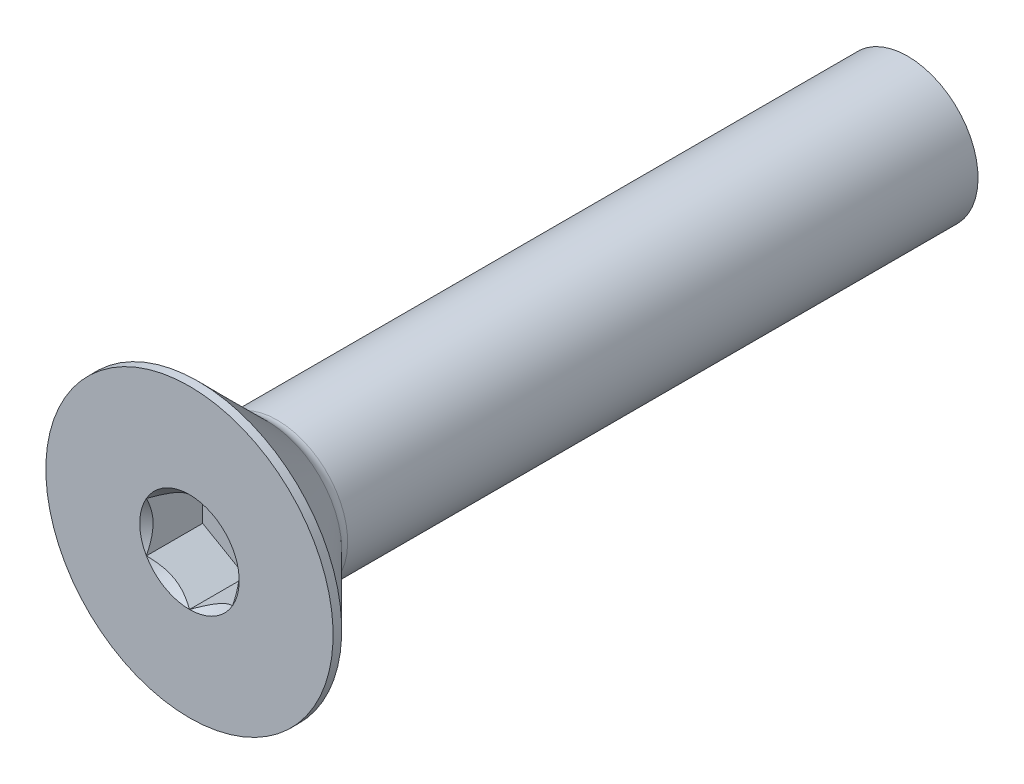
ISO-10303-21;
HEADER;
FILE_DESCRIPTION(('STEP AP214'),'2;1');
FILE_NAME('part.step','',(''),(''),'','','');
FILE_SCHEMA(('AUTOMOTIVE_DESIGN { 1 0 10303 214 1 1 1 1 }'));
ENDSEC;
DATA;
#1=APPLICATION_CONTEXT('core data for automotive mechanical design processes');
#2=APPLICATION_PROTOCOL_DEFINITION('international standard','automotive_design',2000,#1);
#3=PRODUCT_CONTEXT('',#1,'mechanical');
#4=PRODUCT('Part','Part','',(#3));
#5=PRODUCT_RELATED_PRODUCT_CATEGORY('part','',(#4));
#6=PRODUCT_DEFINITION_FORMATION('','',#4);
#7=PRODUCT_DEFINITION_CONTEXT('part definition',#1,'design');
#8=PRODUCT_DEFINITION('design','',#6,#7);
#9=PRODUCT_DEFINITION_SHAPE('','',#8);
#10=(LENGTH_UNIT() NAMED_UNIT(*) SI_UNIT(.MILLI.,.METRE.));
#11=(NAMED_UNIT(*) PLANE_ANGLE_UNIT() SI_UNIT($,.RADIAN.));
#12=(NAMED_UNIT(*) SI_UNIT($,.STERADIAN.) SOLID_ANGLE_UNIT());
#13=UNCERTAINTY_MEASURE_WITH_UNIT(LENGTH_MEASURE(1.E-05),#10,'distance_accuracy_value','');
#14=(GEOMETRIC_REPRESENTATION_CONTEXT(3) GLOBAL_UNCERTAINTY_ASSIGNED_CONTEXT((#13)) GLOBAL_UNIT_ASSIGNED_CONTEXT((#10,
#11,#12)) REPRESENTATION_CONTEXT('',''));
#15=CARTESIAN_POINT('',(0.,0.,0.));
#16=DIRECTION('',(0.,0.,1.));
#17=DIRECTION('',(1.,0.,0.));
#18=AXIS2_PLACEMENT_3D('',#15,#16,#17);
#19=CARTESIAN_POINT('',(1.5,-0.866025403784439,-1.96));
#20=DIRECTION('',(0.,0.,1.));
#21=DIRECTION('',(1.,0.,0.));
#22=AXIS2_PLACEMENT_3D('',#19,#20,#21);
#23=PLANE('',#22);
#24=DIRECTION('',(0.,1.,0.));
#25=VECTOR('',#24,1.);
#26=CARTESIAN_POINT('',(-1.5,0.86602540378444,-1.96));
#27=LINE('',#26,#25);
#28=CARTESIAN_POINT('',(-1.5,0.866025403784441,-1.96));
#29=VERTEX_POINT('',#28);
#30=CARTESIAN_POINT('',(-1.5,-0.866025403784438,-1.96));
#31=VERTEX_POINT('',#30);
#32=EDGE_CURVE('E82',#29,#31,#27,.F.);
#33=ORIENTED_EDGE('',*,*,#32,.T.);
#34=DIRECTION('',(0.866025403784439,-0.5,0.));
#35=VECTOR('',#34,1.);
#36=CARTESIAN_POINT('',(-1.5,-0.866025403784438,-1.96));
#37=LINE('',#36,#35);
#38=CARTESIAN_POINT('',(0.,-1.73205080756888,-1.96));
#39=VERTEX_POINT('',#38);
#40=EDGE_CURVE('E84',#31,#39,#37,.T.);
#41=ORIENTED_EDGE('',*,*,#40,.T.);
#42=DIRECTION('',(0.866025403784439,0.5,0.));
#43=VECTOR('',#42,1.);
#44=CARTESIAN_POINT('',(0.,-1.73205080756888,-1.96));
#45=LINE('',#44,#43);
#46=CARTESIAN_POINT('',(1.5,-0.866025403784443,-1.96));
#47=VERTEX_POINT('',#46);
#48=EDGE_CURVE('E85',#39,#47,#45,.T.);
#49=ORIENTED_EDGE('',*,*,#48,.T.);
#50=DIRECTION('',(0.,1.,0.));
#51=VECTOR('',#50,1.);
#52=CARTESIAN_POINT('',(1.5,-0.866025403784439,-1.96));
#53=LINE('',#52,#51);
#54=CARTESIAN_POINT('',(1.5,0.866025403784441,-1.96));
#55=VERTEX_POINT('',#54);
#56=EDGE_CURVE('E71',#47,#55,#53,.T.);
#57=ORIENTED_EDGE('',*,*,#56,.T.);
#58=DIRECTION('',(-0.866025403784439,0.5,0.));
#59=VECTOR('',#58,1.);
#60=CARTESIAN_POINT('',(1.5,0.866025403784441,-1.96));
#61=LINE('',#60,#59);
#62=CARTESIAN_POINT('',(0.,1.73205080756888,-1.96));
#63=VERTEX_POINT('',#62);
#64=EDGE_CURVE('E110',#55,#63,#61,.T.);
#65=ORIENTED_EDGE('',*,*,#64,.T.);
#66=DIRECTION('',(-0.866025403784439,-0.5,0.));
#67=VECTOR('',#66,1.);
#68=CARTESIAN_POINT('',(0.,1.73205080756888,-1.96));
#69=LINE('',#68,#67);
#70=EDGE_CURVE('E115',#63,#29,#69,.T.);
#71=ORIENTED_EDGE('',*,*,#70,.T.);
#72=EDGE_LOOP('',(#33,#41,#49,#57,#65,#71));
#73=FACE_BOUND('',#72,.T.);
#74=ADVANCED_FACE('F16',(#73),#23,.T.);
#75=CARTESIAN_POINT('',(0.,-1.73205080756888,-1.96));
#76=DIRECTION('',(0.5,-0.866025403784439,0.));
#77=DIRECTION('',(0.866025403784439,0.5,0.));
#78=AXIS2_PLACEMENT_3D('',#75,#76,#77);
#79=PLANE('',#78);
#80=CARTESIAN_POINT('',(-2.47259574257012E-11,-1.73205080758293,-3.49735601031853E-11));
#81=CARTESIAN_POINT('',(0.0515557327287652,-1.70228509139958,-0.0297371504849992));
#82=CARTESIAN_POINT('',(0.103973478126706,-1.67202169198382,-0.0577274997332092));
#83=CARTESIAN_POINT('',(0.210858640221865,-1.61031151487585,-0.108976634295227));
#84=CARTESIAN_POINT('',(0.265336216149331,-1.57885887174931,-0.132206913925154));
#85=CARTESIAN_POINT('',(0.375187576360525,-1.51543615936052,-0.172000539063642));
#86=CARTESIAN_POINT('',(0.43053339988551,-1.48348223324985,-0.188663877355985));
#87=CARTESIAN_POINT('',(0.542443144668123,-1.41887111197467,-0.214336924391901));
#88=CARTESIAN_POINT('',(0.599003649706897,-1.38621588916503,-0.223365789908323));
#89=CARTESIAN_POINT('',(0.696490927156706,-1.32993158328682,-0.231512589340651));
#90=CARTESIAN_POINT('',(0.737291861858445,-1.30637515265359,-0.232718117543906));
#91=CARTESIAN_POINT('',(0.818821659252822,-1.25930390218097,-0.230683861819337));
#92=CARTESIAN_POINT('',(0.859550504035244,-1.23578909268205,-0.227443095934658));
#93=CARTESIAN_POINT('',(0.940615934798049,-1.18898594440918,-0.216702694706974));
#94=CARTESIAN_POINT('',(0.980952120495591,-1.16569783673862,-0.209199099094188));
#95=CARTESIAN_POINT('',(1.06094744874167,-1.11951251244183,-0.190340526389358));
#96=CARTESIAN_POINT('',(1.10060629309088,-1.09661546798107,-0.178983896683504));
#97=CARTESIAN_POINT('',(1.20214987033849,-1.03798925632268,-0.145281418581613));
#98=CARTESIAN_POINT('',(1.26340587981439,-1.00262308276229,-0.120399016466315));
#99=CARTESIAN_POINT('',(1.35347611110698,-0.95062101047954,-0.0783962697862522));
#100=CARTESIAN_POINT('',(1.38315704855032,-0.933484713256822,-0.0636393457173686));
#101=CARTESIAN_POINT('',(1.44197336897757,-0.899527094825411,-0.0327784720806822));
#102=CARTESIAN_POINT('',(1.4711090035625,-0.882705628354791,-0.0166751634684284));
#103=CARTESIAN_POINT('',(1.50000000002465,-0.866025403770208,-3.50669943573556E-11));
#104=B_SPLINE_CURVE_WITH_KNOTS('',3,(#80,#81,#82,#83,#84,#85,#86,#87,#88,#89,#90,#91,#92,#93,
#94,#95,#96,#97,#98,#99,#100,#101,#102,#103),.UNSPECIFIED.,.F.,.F.,(4,2,2,2,2,2,2,2,2,2,2,4),
(0.,0.199774419910087,0.400712312277697,0.598459990337991,0.795709985707598,0.936894690871219,
1.07811058146816,1.21945788001607,1.36086588096647,1.58533909988034,1.69726364731886,
1.80913521242831),.UNSPECIFIED.);
#105=CARTESIAN_POINT('',(0.,-1.73205080759353,-2.46512000274415E-11));
#106=VERTEX_POINT('',#105);
#107=CARTESIAN_POINT('',(1.50000000001233,-0.866025403826622,-1.7529512729912E-11));
#108=VERTEX_POINT('',#107);
#109=EDGE_CURVE('E19',#106,#108,#104,.T.);
#110=ORIENTED_EDGE('',*,*,#109,.T.);
#111=DIRECTION('',(0.,0.,-1.));
#112=VECTOR('',#111,1.);
#113=CARTESIAN_POINT('',(1.5,-0.866025403784444,-1.96));
#114=LINE('',#113,#112);
#115=EDGE_CURVE('E90',#108,#47,#114,.T.);
#116=ORIENTED_EDGE('',*,*,#115,.T.);
#117=ORIENTED_EDGE('',*,*,#48,.F.);
#118=DIRECTION('',(0.,0.,1.));
#119=VECTOR('',#118,1.);
#120=CARTESIAN_POINT('',(0.,-1.73205080756888,-1.96));
#121=LINE('',#120,#119);
#122=EDGE_CURVE('E58',#39,#106,#121,.T.);
#123=ORIENTED_EDGE('',*,*,#122,.T.);
#124=EDGE_LOOP('',(#110,#116,#117,#123));
#125=FACE_BOUND('',#124,.T.);
#126=ADVANCED_FACE('F89',(#125),#79,.F.);
#127=CARTESIAN_POINT('',(-1.5,-0.866025403784438,-1.96));
#128=DIRECTION('',(-0.5,-0.866025403784439,0.));
#129=DIRECTION('',(0.866025403784439,-0.5,0.));
#130=AXIS2_PLACEMENT_3D('',#127,#128,#129);
#131=PLANE('',#130);
#132=CARTESIAN_POINT('',(-1.50000000002453,-0.866025403770047,-3.49735188727095E-11));
#133=CARTESIAN_POINT('',(-1.44844426727117,-0.895791119953616,-0.0297371504849996));
#134=CARTESIAN_POINT('',(-1.39602652187328,-0.92605451936946,-0.05772749973321));
#135=CARTESIAN_POINT('',(-1.28914135977816,-0.987764696477499,-0.108976634295229));
#136=CARTESIAN_POINT('',(-1.23466378385068,-1.01921733960401,-0.132206913925156));
#137=CARTESIAN_POINT('',(-1.12481242363947,-1.08264005199279,-0.172000539063644));
#138=CARTESIAN_POINT('',(-1.06946660011449,-1.11459397810346,-0.188663877355987));
#139=CARTESIAN_POINT('',(-0.95755685533188,-1.17920509937865,-0.214336924391904));
#140=CARTESIAN_POINT('',(-0.900996350293104,-1.21186032218828,-0.223365789908326));
#141=CARTESIAN_POINT('',(-0.803509072843294,-1.26814462806649,-0.231512589340655));
#142=CARTESIAN_POINT('',(-0.762708138141555,-1.29170105869973,-0.232718117543909));
#143=CARTESIAN_POINT('',(-0.68117834074718,-1.33877230917235,-0.23068386181934));
#144=CARTESIAN_POINT('',(-0.640449495964757,-1.36228711867126,-0.227443095934661));
#145=CARTESIAN_POINT('',(-0.559384065201952,-1.40909026694414,-0.216702694706977));
#146=CARTESIAN_POINT('',(-0.51904787950441,-1.4323783746147,-0.209199099094191));
#147=CARTESIAN_POINT('',(-0.439052551258332,-1.47856369891149,-0.190340526389361));
#148=CARTESIAN_POINT('',(-0.399393706909126,-1.50146074337225,-0.178983896683507));
#149=CARTESIAN_POINT('',(-0.297850129661507,-1.56008695503064,-0.145281418581616));
#150=CARTESIAN_POINT('',(-0.236594120185607,-1.59545312859103,-0.120399016466318));
#151=CARTESIAN_POINT('',(-0.146523888893021,-1.64745520087378,-0.0783962697862532));
#152=CARTESIAN_POINT('',(-0.116842951449673,-1.6645914980965,-0.0636393457173691));
#153=CARTESIAN_POINT('',(-0.0580266310224297,-1.69854911652791,-0.0327784720806818));
#154=CARTESIAN_POINT('',(-0.0288909964374982,-1.71537058299853,-0.0166751634684276));
#155=CARTESIAN_POINT('',(2.46594881366221E-11,-1.73205080758311,-3.50661272419403E-11));
#156=B_SPLINE_CURVE_WITH_KNOTS('',3,(#132,#133,#134,#135,#136,#137,#138,#139,#140,#141,#142,
#143,#144,#145,#146,#147,#148,#149,#150,#151,#152,#153,#154,#155),.UNSPECIFIED.,.F.,.F.,(4,2,2,
2,2,2,2,2,2,2,2,4),(0.,0.199774419910088,0.4007123122777,0.598459990337995,0.795709985707603,
0.936894690871224,1.07811058146816,1.21945788001607,1.36086588096647,1.58533909988035,
1.69726364731887,1.80913521242833),.UNSPECIFIED.);
#157=CARTESIAN_POINT('',(-1.50000000002135,-0.866025403796764,-2.46512611627816E-11));
#158=VERTEX_POINT('',#157);
#159=EDGE_CURVE('E94',#158,#106,#156,.T.);
#160=ORIENTED_EDGE('',*,*,#159,.T.);
#161=ORIENTED_EDGE('',*,*,#122,.F.);
#162=ORIENTED_EDGE('',*,*,#40,.F.);
#163=DIRECTION('',(0.,0.,1.));
#164=VECTOR('',#163,1.);
#165=CARTESIAN_POINT('',(-1.5,-0.866025403784438,-1.96));
#166=LINE('',#165,#164);
#167=EDGE_CURVE('E96',#31,#158,#166,.T.);
#168=ORIENTED_EDGE('',*,*,#167,.T.);
#169=EDGE_LOOP('',(#160,#161,#162,#168));
#170=FACE_BOUND('',#169,.T.);
#171=ADVANCED_FACE('F92',(#170),#131,.F.);
#172=CARTESIAN_POINT('',(-1.5,0.86602540378444,-1.96));
#173=DIRECTION('',(-1.,0.,0.));
#174=DIRECTION('',(0.,0.,1.));
#175=AXIS2_PLACEMENT_3D('',#172,#173,#174);
#176=PLANE('',#175);
#177=CARTESIAN_POINT('',(-1.4999999999998,0.866025403812883,-3.49728838199371E-11));
#178=CARTESIAN_POINT('',(-1.49999999999993,0.806493971458483,-0.0297371504859719));
#179=CARTESIAN_POINT('',(-1.49999999999998,0.745967172639482,-0.0577274997356711));
#180=CARTESIAN_POINT('',(-1.50000000000002,0.622546818448653,-0.108976634302055));
#181=CARTESIAN_POINT('',(-1.50000000000001,0.559641532208188,-0.132206913934862));
#182=CARTESIAN_POINT('',(-1.5,0.432796107455125,-0.172000539080811));
#183=CARTESIAN_POINT('',(-1.5,0.368888255245699,-0.188663877377684));
#184=CARTESIAN_POINT('',(-1.5,0.239666012718551,-0.214336924424236));
#185=CARTESIAN_POINT('',(-1.5,0.174355567110582,-0.223365789946761));
#186=CARTESIAN_POINT('',(-1.5,0.0617869553803675,-0.231512589389946));
#187=CARTESIAN_POINT('',(-1.5,0.0146740941290624,-0.232718117598397));
#188=CARTESIAN_POINT('',(-1.5,-0.0794684067864033,-0.230683861885897));
#189=CARTESIAN_POINT('',(-1.5,-0.126498025769629,-0.227443096008093));
#190=CARTESIAN_POINT('',(-1.5,-0.22010432228685,-0.21670269479537));
#191=CARTESIAN_POINT('',(-1.5,-0.266680537614034,-0.209199099190673));
#192=CARTESIAN_POINT('',(-1.5,-0.359051186180354,-0.190340526502742));
#193=CARTESIAN_POINT('',(-1.5,-0.404845275088566,-0.178983896805698));
#194=CARTESIAN_POINT('',(-1.5,-0.522097698449399,-0.145281418704612));
#195=CARTESIAN_POINT('',(-1.5,-0.592830045625335,-0.120399016572433));
#196=CARTESIAN_POINT('',(-1.5,-0.696834190269759,-0.0783962698582896));
#197=CARTESIAN_POINT('',(-1.5,-0.731106784740956,-0.0636393457765504));
#198=CARTESIAN_POINT('',(-1.5,-0.799022021654026,-0.0327784721118597));
#199=CARTESIAN_POINT('',(-1.5,-0.832664954619754,-0.0166751634844623));
#200=CARTESIAN_POINT('',(-1.5,-0.866025403812908,-3.50675447938045E-11));
#201=B_SPLINE_CURVE_WITH_KNOTS('',3,(#177,#178,#179,#180,#181,#182,#183,#184,#185,#186,#187,
#188,#189,#190,#191,#192,#193,#194,#195,#196,#197,#198,#199,#200),.UNSPECIFIED.,.F.,.F.,(4,2,2,
2,2,2,2,2,2,2,2,4),(0.,0.199774419877747,0.400712312213008,0.598459990242252,0.795709985580835,
0.936894690699466,1.07811058125136,1.21945787975417,1.36086588065946,1.58533909974464,
1.69726364726936,1.80913521246463),.UNSPECIFIED.);
#202=CARTESIAN_POINT('',(-1.50000000002135,0.866025403796766,-2.4649930155814E-11));
#203=VERTEX_POINT('',#202);
#204=EDGE_CURVE('E194',#203,#158,#201,.T.);
#205=ORIENTED_EDGE('',*,*,#204,.T.);
#206=ORIENTED_EDGE('',*,*,#167,.F.);
#207=ORIENTED_EDGE('',*,*,#32,.F.);
#208=DIRECTION('',(0.,0.,1.));
#209=VECTOR('',#208,1.);
#210=CARTESIAN_POINT('',(-1.5,0.866025403784441,-1.96));
#211=LINE('',#210,#209);
#212=EDGE_CURVE('E112',#29,#203,#211,.T.);
#213=ORIENTED_EDGE('',*,*,#212,.T.);
#214=EDGE_LOOP('',(#205,#206,#207,#213));
#215=FACE_BOUND('',#214,.T.);
#216=ADVANCED_FACE('F204',(#215),#176,.F.);
#217=CARTESIAN_POINT('',(0.,1.73205080756888,-1.96));
#218=DIRECTION('',(-0.5,0.866025403784439,0.));
#219=DIRECTION('',(-0.866025403784439,-0.5,0.));
#220=AXIS2_PLACEMENT_3D('',#217,#218,#219);
#221=PLANE('',#220);
#222=CARTESIAN_POINT('',(2.4728991880651E-11,1.73205080758293,-3.49714446682978E-11));
#223=CARTESIAN_POINT('',(-0.0515557327287626,1.70228509139958,-0.0297371504849972));
#224=CARTESIAN_POINT('',(-0.103973478126703,1.67202169198382,-0.0577274997332075));
#225=CARTESIAN_POINT('',(-0.210858640221863,1.61031151487585,-0.108976634295226));
#226=CARTESIAN_POINT('',(-0.265336216149329,1.57885887174931,-0.132206913925153));
#227=CARTESIAN_POINT('',(-0.375187576360524,1.51543615936052,-0.172000539063641));
#228=CARTESIAN_POINT('',(-0.430533399885508,1.48348223324986,-0.188663877355984));
#229=CARTESIAN_POINT('',(-0.542443144668122,1.41887111197467,-0.214336924391901));
#230=CARTESIAN_POINT('',(-0.599003649706896,1.38621588916504,-0.223365789908323));
#231=CARTESIAN_POINT('',(-0.696490927156706,1.32993158328682,-0.231512589340651));
#232=CARTESIAN_POINT('',(-0.737291861858445,1.30637515265359,-0.232718117543906));
#233=CARTESIAN_POINT('',(-0.818821659252821,1.25930390218097,-0.230683861819337));
#234=CARTESIAN_POINT('',(-0.859550504035243,1.23578909268205,-0.227443095934658));
#235=CARTESIAN_POINT('',(-0.940615934798048,1.18898594440918,-0.216702694706974));
#236=CARTESIAN_POINT('',(-0.980952120495591,1.16569783673862,-0.209199099094188));
#237=CARTESIAN_POINT('',(-1.06094744874167,1.11951251244183,-0.190340526389358));
#238=CARTESIAN_POINT('',(-1.10060629309087,1.09661546798107,-0.178983896683504));
#239=CARTESIAN_POINT('',(-1.20214987033849,1.03798925632268,-0.145281418581613));
#240=CARTESIAN_POINT('',(-1.26340587981439,1.00262308276228,-0.120399016466315));
#241=CARTESIAN_POINT('',(-1.35347611110698,0.95062101047954,-0.0783962697862518));
#242=CARTESIAN_POINT('',(-1.38315704855032,0.933484713256822,-0.0636393457173681));
#243=CARTESIAN_POINT('',(-1.44197336897757,0.89952709482541,-0.0327784720806814));
#244=CARTESIAN_POINT('',(-1.4711090035625,0.88270562835479,-0.0166751634684274));
#245=CARTESIAN_POINT('',(-1.50000000002466,0.866025403770207,-3.50659339800821E-11));
#246=B_SPLINE_CURVE_WITH_KNOTS('',3,(#222,#223,#224,#225,#226,#227,#228,#229,#230,#231,#232,
#233,#234,#235,#236,#237,#238,#239,#240,#241,#242,#243,#244,#245),.UNSPECIFIED.,.F.,.F.,(4,2,2,
2,2,2,2,2,2,2,2,4),(0.,0.199774419910088,0.400712312277699,0.598459990337993,0.795709985707601,
0.936894690871222,1.07811058146816,1.21945788001607,1.36086588096647,1.58533909988034,
1.69726364731887,1.80913521242832),.UNSPECIFIED.);
#247=CARTESIAN_POINT('',(0.,1.73205080759353,-2.46500385700291E-11));
#248=VERTEX_POINT('',#247);
#249=EDGE_CURVE('E186',#248,#203,#246,.T.);
#250=ORIENTED_EDGE('',*,*,#249,.T.);
#251=ORIENTED_EDGE('',*,*,#212,.F.);
#252=ORIENTED_EDGE('',*,*,#70,.F.);
#253=DIRECTION('',(0.,0.,1.));
#254=VECTOR('',#253,1.);
#255=CARTESIAN_POINT('',(0.,1.73205080756888,-1.96));
#256=LINE('',#255,#254);
#257=EDGE_CURVE('E107',#63,#248,#256,.T.);
#258=ORIENTED_EDGE('',*,*,#257,.T.);
#259=EDGE_LOOP('',(#250,#251,#252,#258));
#260=FACE_BOUND('',#259,.T.);
#261=ADVANCED_FACE('F200',(#260),#221,.F.);
#262=CARTESIAN_POINT('',(1.5,0.866025403784441,-1.96));
#263=DIRECTION('',(0.5,0.866025403784439,0.));
#264=DIRECTION('',(-0.866025403784439,0.5,0.));
#265=AXIS2_PLACEMENT_3D('',#262,#263,#264);
#266=PLANE('',#265);
#267=CARTESIAN_POINT('',(1.50000000002453,0.866025403770052,-3.49738883752871E-11));
#268=CARTESIAN_POINT('',(1.44844426727117,0.895791119953621,-0.0297371504849995));
#269=CARTESIAN_POINT('',(1.39602652187328,0.926054519369464,-0.0577274997332094));
#270=CARTESIAN_POINT('',(1.28914135977816,0.987764696477503,-0.108976634295227));
#271=CARTESIAN_POINT('',(1.23466378385068,1.01921733960402,-0.132206913925154));
#272=CARTESIAN_POINT('',(1.12481242363947,1.08264005199279,-0.172000539063642));
#273=CARTESIAN_POINT('',(1.06946660011449,1.11459397810346,-0.188663877355985));
#274=CARTESIAN_POINT('',(0.95755685533188,1.17920509937865,-0.214336924391902));
#275=CARTESIAN_POINT('',(0.900996350293105,1.21186032218829,-0.223365789908324));
#276=CARTESIAN_POINT('',(0.803509072843295,1.2681446280665,-0.231512589340652));
#277=CARTESIAN_POINT('',(0.762708138141556,1.29170105869973,-0.232718117543906));
#278=CARTESIAN_POINT('',(0.68117834074718,1.33877230917235,-0.230683861819337));
#279=CARTESIAN_POINT('',(0.640449495964758,1.36228711867127,-0.227443095934658));
#280=CARTESIAN_POINT('',(0.559384065201953,1.40909026694414,-0.216702694706974));
#281=CARTESIAN_POINT('',(0.51904787950441,1.4323783746147,-0.209199099094188));
#282=CARTESIAN_POINT('',(0.439052551258333,1.47856369891149,-0.190340526389358));
#283=CARTESIAN_POINT('',(0.399393706909126,1.50146074337225,-0.178983896683504));
#284=CARTESIAN_POINT('',(0.297850129661508,1.56008695503064,-0.145281418581613));
#285=CARTESIAN_POINT('',(0.236594120185609,1.59545312859104,-0.120399016466315));
#286=CARTESIAN_POINT('',(0.146523888893024,1.64745520087378,-0.0783962697862516));
#287=CARTESIAN_POINT('',(0.116842951449676,1.6645914980965,-0.0636393457173678));
#288=CARTESIAN_POINT('',(0.0580266310224336,1.69854911652791,-0.0327784720806811));
#289=CARTESIAN_POINT('',(0.0288909964375026,1.71537058299853,-0.0166751634684272));
#290=CARTESIAN_POINT('',(-2.46547607172129E-11,1.73205080758311,-3.50657302387268E-11));
#291=B_SPLINE_CURVE_WITH_KNOTS('',3,(#267,#268,#269,#270,#271,#272,#273,#274,#275,#276,#277,
#278,#279,#280,#281,#282,#283,#284,#285,#286,#287,#288,#289,#290),.UNSPECIFIED.,.F.,.F.,(4,2,2,
2,2,2,2,2,2,2,2,4),(0.,0.199774419910087,0.400712312277698,0.598459990337992,0.795709985707599,
0.936894690871219,1.07811058146816,1.21945788001607,1.36086588096647,1.58533909988034,
1.69726364731886,1.80913521242832),.UNSPECIFIED.);
#292=CARTESIAN_POINT('',(1.50000000002135,0.866025403796767,-2.46505276107314E-11));
#293=VERTEX_POINT('',#292);
#294=EDGE_CURVE('E156',#293,#248,#291,.T.);
#295=ORIENTED_EDGE('',*,*,#294,.T.);
#296=ORIENTED_EDGE('',*,*,#257,.F.);
#297=ORIENTED_EDGE('',*,*,#64,.F.);
#298=DIRECTION('',(0.,0.,-1.));
#299=VECTOR('',#298,1.);
#300=CARTESIAN_POINT('',(1.5,0.866025403784441,-1.96));
#301=LINE('',#300,#299);
#302=EDGE_CURVE('E39',#55,#293,#301,.F.);
#303=ORIENTED_EDGE('',*,*,#302,.T.);
#304=EDGE_LOOP('',(#295,#296,#297,#303));
#305=FACE_BOUND('',#304,.T.);
#306=ADVANCED_FACE('F203',(#305),#266,.F.);
#307=CARTESIAN_POINT('',(1.5,-0.866025403784439,-1.96));
#308=DIRECTION('',(1.,0.,0.));
#309=DIRECTION('',(0.,0.,-1.));
#310=AXIS2_PLACEMENT_3D('',#307,#308,#309);
#311=PLANE('',#310);
#312=CARTESIAN_POINT('',(1.4999999999998,-0.866025403812885,-3.49714520330393E-11));
#313=CARTESIAN_POINT('',(1.49999999999993,-0.806493971458486,-0.029737150485971));
#314=CARTESIAN_POINT('',(1.49999999999998,-0.745967172639484,-0.0577274997356704));
#315=CARTESIAN_POINT('',(1.50000000000002,-0.622546818448655,-0.108976634302055));
#316=CARTESIAN_POINT('',(1.50000000000001,-0.55964153220819,-0.132206913934862));
#317=CARTESIAN_POINT('',(1.5,-0.432796107455127,-0.172000539080811));
#318=CARTESIAN_POINT('',(1.5,-0.3688882552457,-0.188663877377684));
#319=CARTESIAN_POINT('',(1.5,-0.239666012718552,-0.214336924424235));
#320=CARTESIAN_POINT('',(1.5,-0.174355567110583,-0.223365789946761));
#321=CARTESIAN_POINT('',(1.5,-0.0617869553803688,-0.231512589389946));
#322=CARTESIAN_POINT('',(1.5,-0.0146740941290638,-0.232718117598397));
#323=CARTESIAN_POINT('',(1.5,0.0794684067864019,-0.230683861885897));
#324=CARTESIAN_POINT('',(1.5,0.126498025769628,-0.227443096008093));
#325=CARTESIAN_POINT('',(1.5,0.220104322286849,-0.216702694795371));
#326=CARTESIAN_POINT('',(1.5,0.266680537614033,-0.209199099190674));
#327=CARTESIAN_POINT('',(1.5,0.359051186180353,-0.190340526502742));
#328=CARTESIAN_POINT('',(1.5,0.404845275088565,-0.178983896805698));
#329=CARTESIAN_POINT('',(1.5,0.522097698449399,-0.145281418704612));
#330=CARTESIAN_POINT('',(1.5,0.592830045625336,-0.120399016572433));
#331=CARTESIAN_POINT('',(1.5,0.696834190269762,-0.0783962698582885));
#332=CARTESIAN_POINT('',(1.5,0.731106784740959,-0.0636393457765492));
#333=CARTESIAN_POINT('',(1.5,0.799022021654029,-0.0327784721118581));
#334=CARTESIAN_POINT('',(1.5,0.832664954619758,-0.0166751634844605));
#335=CARTESIAN_POINT('',(1.5,0.866025403812912,-3.50653760688949E-11));
#336=B_SPLINE_CURVE_WITH_KNOTS('',3,(#312,#313,#314,#315,#316,#317,#318,#319,#320,#321,#322,
#323,#324,#325,#326,#327,#328,#329,#330,#331,#332,#333,#334,#335),.UNSPECIFIED.,.F.,.F.,(4,2,2,
2,2,2,2,2,2,2,2,4),(0.,0.199774419877747,0.400712312213009,0.598459990242254,0.795709985580836,
0.936894690699468,1.07811058125136,1.21945787975417,1.36086588065946,1.58533909974465,
1.69726364726936,1.80913521246464),.UNSPECIFIED.);
#337=EDGE_CURVE('E148',#108,#293,#336,.T.);
#338=ORIENTED_EDGE('',*,*,#337,.T.);
#339=ORIENTED_EDGE('',*,*,#302,.F.);
#340=ORIENTED_EDGE('',*,*,#56,.F.);
#341=ORIENTED_EDGE('',*,*,#115,.F.);
#342=EDGE_LOOP('',(#338,#339,#340,#341));
#343=FACE_BOUND('',#342,.T.);
#344=ADVANCED_FACE('F164',(#343),#311,.F.);
#345=CARTESIAN_POINT('',(0.,0.,0.));
#346=DIRECTION('',(0.,0.,1.));
#347=DIRECTION('',(1.,0.,0.));
#348=AXIS2_PLACEMENT_3D('',#345,#346,#347);
#349=CONICAL_SURFACE('',#348,1.73205080761818,0.785398163519197);
#350=ORIENTED_EDGE('',*,*,#109,.F.);
#351=CARTESIAN_POINT('',(0.,0.,0.));
#352=DIRECTION('',(0.,0.,1.));
#353=DIRECTION('',(1.,0.,0.));
#354=AXIS2_PLACEMENT_3D('',#351,#352,#353);
#355=CIRCLE('',#354,1.73205080761818);
#356=EDGE_CURVE('E145',#108,#106,#355,.F.);
#357=ORIENTED_EDGE('',*,*,#356,.F.);
#358=EDGE_LOOP('',(#350,#357));
#359=FACE_BOUND('',#358,.T.);
#360=ADVANCED_FACE('F221',(#359),#349,.F.);
#361=CARTESIAN_POINT('',(0.,0.,0.));
#362=DIRECTION('',(0.,0.,1.));
#363=DIRECTION('',(1.,0.,0.));
#364=AXIS2_PLACEMENT_3D('',#361,#362,#363);
#365=CONICAL_SURFACE('',#364,1.73205080761818,0.785398163519197);
#366=ORIENTED_EDGE('',*,*,#159,.F.);
#367=CARTESIAN_POINT('',(0.,0.,0.));
#368=DIRECTION('',(0.,0.,1.));
#369=DIRECTION('',(1.,0.,0.));
#370=AXIS2_PLACEMENT_3D('',#367,#368,#369);
#371=CIRCLE('',#370,1.73205080761818);
#372=EDGE_CURVE('E142',#106,#158,#371,.F.);
#373=ORIENTED_EDGE('',*,*,#372,.F.);
#374=EDGE_LOOP('',(#366,#373));
#375=FACE_BOUND('',#374,.T.);
#376=ADVANCED_FACE('F218',(#375),#365,.F.);
#377=CARTESIAN_POINT('',(0.,0.,0.));
#378=DIRECTION('',(0.,0.,1.));
#379=DIRECTION('',(1.,0.,0.));
#380=AXIS2_PLACEMENT_3D('',#377,#378,#379);
#381=CONICAL_SURFACE('',#380,1.73205080761818,0.785398163397448);
#382=ORIENTED_EDGE('',*,*,#204,.F.);
#383=CARTESIAN_POINT('',(0.,0.,0.));
#384=DIRECTION('',(0.,0.,1.));
#385=DIRECTION('',(1.,0.,0.));
#386=AXIS2_PLACEMENT_3D('',#383,#384,#385);
#387=CIRCLE('',#386,1.73205080761818);
#388=EDGE_CURVE('E139',#158,#203,#387,.F.);
#389=ORIENTED_EDGE('',*,*,#388,.F.);
#390=EDGE_LOOP('',(#382,#389));
#391=FACE_BOUND('',#390,.T.);
#392=ADVANCED_FACE('F182',(#391),#381,.F.);
#393=CARTESIAN_POINT('',(0.,0.,0.));
#394=DIRECTION('',(0.,0.,1.));
#395=DIRECTION('',(1.,0.,0.));
#396=AXIS2_PLACEMENT_3D('',#393,#394,#395);
#397=CONICAL_SURFACE('',#396,1.73205080761818,0.785398163519197);
#398=ORIENTED_EDGE('',*,*,#249,.F.);
#399=CARTESIAN_POINT('',(0.,0.,0.));
#400=DIRECTION('',(0.,0.,1.));
#401=DIRECTION('',(1.,0.,0.));
#402=AXIS2_PLACEMENT_3D('',#399,#400,#401);
#403=CIRCLE('',#402,1.73205080761818);
#404=EDGE_CURVE('E136',#203,#248,#403,.F.);
#405=ORIENTED_EDGE('',*,*,#404,.F.);
#406=EDGE_LOOP('',(#398,#405));
#407=FACE_BOUND('',#406,.T.);
#408=ADVANCED_FACE('F177',(#407),#397,.F.);
#409=CARTESIAN_POINT('',(0.,0.,0.));
#410=DIRECTION('',(0.,0.,1.));
#411=DIRECTION('',(1.,0.,0.));
#412=AXIS2_PLACEMENT_3D('',#409,#410,#411);
#413=CONICAL_SURFACE('',#412,1.73205080761818,0.785398163519197);
#414=ORIENTED_EDGE('',*,*,#294,.F.);
#415=CARTESIAN_POINT('',(0.,0.,0.));
#416=DIRECTION('',(0.,0.,1.));
#417=DIRECTION('',(1.,0.,0.));
#418=AXIS2_PLACEMENT_3D('',#415,#416,#417);
#419=CIRCLE('',#418,1.73205080761818);
#420=EDGE_CURVE('E133',#248,#293,#419,.F.);
#421=ORIENTED_EDGE('',*,*,#420,.F.);
#422=EDGE_LOOP('',(#414,#421));
#423=FACE_BOUND('',#422,.T.);
#424=ADVANCED_FACE('F171',(#423),#413,.F.);
#425=CARTESIAN_POINT('',(0.,0.,0.));
#426=DIRECTION('',(0.,0.,1.));
#427=DIRECTION('',(1.,0.,0.));
#428=AXIS2_PLACEMENT_3D('',#425,#426,#427);
#429=CONICAL_SURFACE('',#428,1.73205080761818,0.785398163397448);
#430=CARTESIAN_POINT('',(0.,0.,0.));
#431=DIRECTION('',(0.,0.,1.));
#432=DIRECTION('',(1.,0.,0.));
#433=AXIS2_PLACEMENT_3D('',#430,#431,#432);
#434=CIRCLE('',#433,1.73205080761818);
#435=EDGE_CURVE('E130',#293,#108,#434,.F.);
#436=ORIENTED_EDGE('',*,*,#435,.F.);
#437=ORIENTED_EDGE('',*,*,#337,.F.);
#438=EDGE_LOOP('',(#436,#437));
#439=FACE_BOUND('',#438,.T.);
#440=ADVANCED_FACE('F166',(#439),#429,.F.);
#441=CARTESIAN_POINT('',(0.,-2.5,0.));
#442=DIRECTION('',(0.,0.,1.));
#443=DIRECTION('',(0.,-1.,0.));
#444=AXIS2_PLACEMENT_3D('',#441,#442,#443);
#445=PLANE('',#444);
#446=ORIENTED_EDGE('',*,*,#420,.T.);
#447=ORIENTED_EDGE('',*,*,#435,.T.);
#448=ORIENTED_EDGE('',*,*,#356,.T.);
#449=ORIENTED_EDGE('',*,*,#372,.T.);
#450=ORIENTED_EDGE('',*,*,#388,.T.);
#451=ORIENTED_EDGE('',*,*,#404,.T.);
#452=EDGE_LOOP('',(#446,#447,#448,#449,#450,#451));
#453=FACE_BOUND('',#452,.T.);
#454=CARTESIAN_POINT('',(0.,0.,0.));
#455=DIRECTION('',(0.,0.,1.));
#456=DIRECTION('',(0.,-1.,0.));
#457=AXIS2_PLACEMENT_3D('',#454,#455,#456);
#458=CIRCLE('',#457,4.99999999999999);
#459=CARTESIAN_POINT('',(0.,-4.99999999999999,0.));
#460=VERTEX_POINT('',#459);
#461=EDGE_CURVE('E126',#460,#460,#458,.F.);
#462=ORIENTED_EDGE('',*,*,#461,.F.);
#463=EDGE_LOOP('',(#462));
#464=FACE_BOUND('',#463,.T.);
#465=ADVANCED_FACE('F170',(#453,#464),#445,.T.);
#466=CARTESIAN_POINT('',(0.,0.,0.));
#467=DIRECTION('',(0.,0.,1.));
#468=DIRECTION('',(0.,-1.,0.));
#469=AXIS2_PLACEMENT_3D('',#466,#467,#468);
#470=CYLINDRICAL_SURFACE('',#469,4.99999999999999);
#471=CARTESIAN_POINT('',(0.,0.,-0.300000000038392));
#472=DIRECTION('',(0.,0.,1.));
#473=DIRECTION('',(0.,-1.,0.));
#474=AXIS2_PLACEMENT_3D('',#471,#472,#473);
#475=CIRCLE('',#474,5.0000000000523);
#476=CARTESIAN_POINT('',(0.,-5.0000000000523,-0.300000000038381));
#477=VERTEX_POINT('',#476);
#478=EDGE_CURVE('E129',#477,#477,#475,.F.);
#479=ORIENTED_EDGE('',*,*,#478,.F.);
#480=EDGE_LOOP('',(#479));
#481=FACE_BOUND('',#480,.T.);
#482=ORIENTED_EDGE('',*,*,#461,.T.);
#483=EDGE_LOOP('',(#482));
#484=FACE_BOUND('',#483,.T.);
#485=ADVANCED_FACE('F340',(#481,#484),#470,.T.);
#486=CARTESIAN_POINT('',(0.,0.,-0.300000000038392));
#487=DIRECTION('',(0.,0.,1.));
#488=DIRECTION('',(0.,-1.,0.));
#489=AXIS2_PLACEMENT_3D('',#486,#487,#488);
#490=CONICAL_SURFACE('',#489,5.0000000000523,0.78539816339745);
#491=CARTESIAN_POINT('',(0.,0.,-2.70305339059328));
#492=DIRECTION('',(0.,0.,-1.));
#493=DIRECTION('',(-1.,0.,0.));
#494=AXIS2_PLACEMENT_3D('',#491,#492,#493);
#495=CIRCLE('',#494,2.59694660940673);
#496=CARTESIAN_POINT('',(-2.59694660940673,0.,-2.70305339059328));
#497=VERTEX_POINT('',#496);
#498=EDGE_CURVE('E125',#497,#497,#495,.F.);
#499=ORIENTED_EDGE('',*,*,#498,.T.);
#500=EDGE_LOOP('',(#499));
#501=FACE_BOUND('',#500,.T.);
#502=ORIENTED_EDGE('',*,*,#478,.T.);
#503=EDGE_LOOP('',(#502));
#504=FACE_BOUND('',#503,.T.);
#505=ADVANCED_FACE('F348',(#501,#504),#490,.T.);
#506=CARTESIAN_POINT('',(0.,-2.5,-25.));
#507=DIRECTION('',(0.,0.,-1.));
#508=DIRECTION('',(0.,1.,0.));
#509=AXIS2_PLACEMENT_3D('',#506,#507,#508);
#510=PLANE('',#509);
#511=CARTESIAN_POINT('',(0.,0.,-25.));
#512=DIRECTION('',(0.,0.,-1.));
#513=DIRECTION('',(0.,1.,0.));
#514=AXIS2_PLACEMENT_3D('',#511,#512,#513);
#515=CIRCLE('',#514,2.4505);
#516=CARTESIAN_POINT('',(0.,2.4505,-25.));
#517=VERTEX_POINT('',#516);
#518=EDGE_CURVE('E30',#517,#517,#515,.F.);
#519=ORIENTED_EDGE('',*,*,#518,.F.);
#520=EDGE_LOOP('',(#519));
#521=FACE_BOUND('',#520,.T.);
#522=ADVANCED_FACE('F239',(#521),#510,.T.);
#523=CARTESIAN_POINT('',(0.,0.,-3.05660678118655));
#524=DIRECTION('',(0.,0.,-1.));
#525=DIRECTION('',(-1.,0.,0.));
#526=AXIS2_PLACEMENT_3D('',#523,#524,#525);
#527=TOROIDAL_SURFACE('',#526,2.9505,0.5);
#528=CARTESIAN_POINT('',(0.,0.,-3.05660678118655));
#529=DIRECTION('',(0.,0.,-1.));
#530=DIRECTION('',(0.,1.,0.));
#531=AXIS2_PLACEMENT_3D('',#528,#529,#530);
#532=CIRCLE('',#531,2.4505);
#533=CARTESIAN_POINT('',(0.,2.4505,-3.05660678118655));
#534=VERTEX_POINT('',#533);
#535=EDGE_CURVE('E11',#534,#534,#532,.T.);
#536=ORIENTED_EDGE('',*,*,#535,.F.);
#537=EDGE_LOOP('',(#536));
#538=FACE_BOUND('',#537,.T.);
#539=ORIENTED_EDGE('',*,*,#498,.F.);
#540=EDGE_LOOP('',(#539));
#541=FACE_BOUND('',#540,.T.);
#542=ADVANCED_FACE('F233',(#538,#541),#527,.F.);
#543=CARTESIAN_POINT('',(0.,0.,-25.));
#544=DIRECTION('',(0.,0.,-1.));
#545=DIRECTION('',(0.,1.,0.));
#546=AXIS2_PLACEMENT_3D('',#543,#544,#545);
#547=CYLINDRICAL_SURFACE('',#546,2.4505);
#548=ORIENTED_EDGE('',*,*,#535,.T.);
#549=EDGE_LOOP('',(#548));
#550=FACE_BOUND('',#549,.T.);
#551=ORIENTED_EDGE('',*,*,#518,.T.);
#552=EDGE_LOOP('',(#551));
#553=FACE_BOUND('',#552,.T.);
#554=ADVANCED_FACE('F231',(#550,#553),#547,.T.);
#555=CLOSED_SHELL('',(#74,#126,#171,#216,#261,#306,#344,#360,#376,#392,#408,#424,#440,#465,#485,
#505,#522,#542,#554));
#556=MANIFOLD_SOLID_BREP('B1',#555);
#557=ADVANCED_BREP_SHAPE_REPRESENTATION('',(#18,#556),#14);
#558=SHAPE_DEFINITION_REPRESENTATION(#9,#557);
ENDSEC;
END-ISO-10303-21;
